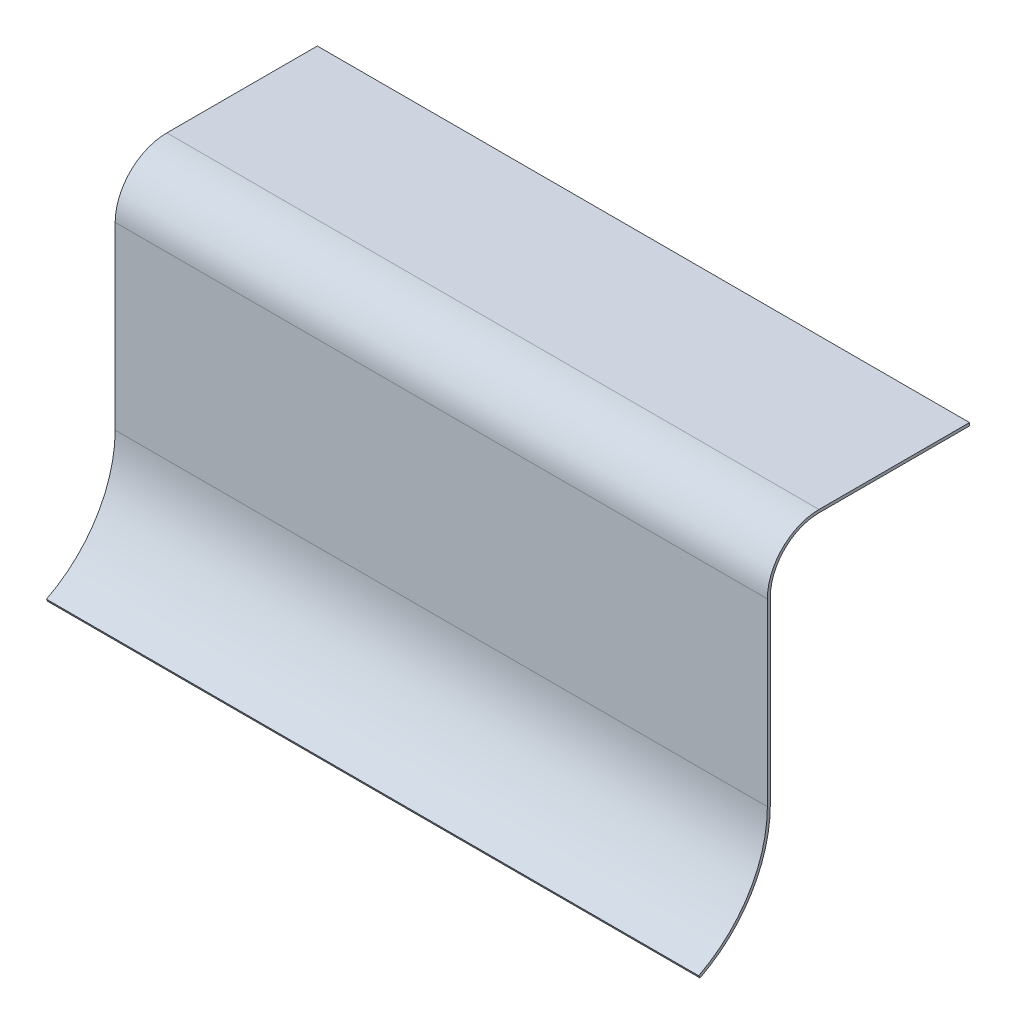
ISO-10303-21;
HEADER;
FILE_DESCRIPTION(('STEP AP214'),'2;1');
FILE_NAME('part.step','',(''),(''),'','','');
FILE_SCHEMA(('AUTOMOTIVE_DESIGN { 1 0 10303 214 1 1 1 1 }'));
ENDSEC;
DATA;
#1=APPLICATION_CONTEXT('core data for automotive mechanical design processes');
#2=APPLICATION_PROTOCOL_DEFINITION('international standard','automotive_design',2000,#1);
#3=PRODUCT_CONTEXT('',#1,'mechanical');
#4=PRODUCT('Part','Part','',(#3));
#5=PRODUCT_RELATED_PRODUCT_CATEGORY('part','',(#4));
#6=PRODUCT_DEFINITION_FORMATION('','',#4);
#7=PRODUCT_DEFINITION_CONTEXT('part definition',#1,'design');
#8=PRODUCT_DEFINITION('design','',#6,#7);
#9=PRODUCT_DEFINITION_SHAPE('','',#8);
#10=(LENGTH_UNIT() NAMED_UNIT(*) SI_UNIT(.MILLI.,.METRE.));
#11=(NAMED_UNIT(*) PLANE_ANGLE_UNIT() SI_UNIT($,.RADIAN.));
#12=(NAMED_UNIT(*) SI_UNIT($,.STERADIAN.) SOLID_ANGLE_UNIT());
#13=UNCERTAINTY_MEASURE_WITH_UNIT(LENGTH_MEASURE(1.E-05),#10,'distance_accuracy_value','');
#14=(GEOMETRIC_REPRESENTATION_CONTEXT(3) GLOBAL_UNCERTAINTY_ASSIGNED_CONTEXT((#13)) GLOBAL_UNIT_ASSIGNED_CONTEXT((#10,
#11,#12)) REPRESENTATION_CONTEXT('',''));
#15=CARTESIAN_POINT('',(0.,0.,0.));
#16=DIRECTION('',(0.,0.,1.));
#17=DIRECTION('',(1.,0.,0.));
#18=AXIS2_PLACEMENT_3D('',#15,#16,#17);
#19=CARTESIAN_POINT('',(165.1,-0.75,0.));
#20=DIRECTION('',(0.,1.,0.));
#21=DIRECTION('',(0.,0.,1.));
#22=AXIS2_PLACEMENT_3D('',#19,#20,#21);
#23=PLANE('',#22);
#24=DIRECTION('',(0.,0.,-1.));
#25=VECTOR('',#24,1.);
#26=CARTESIAN_POINT('',(-165.1,-0.75,0.));
#27=LINE('',#26,#25);
#28=CARTESIAN_POINT('',(-165.1,-0.75,0.));
#29=VERTEX_POINT('',#28);
#30=CARTESIAN_POINT('',(-165.1,-0.75,-76.2));
#31=VERTEX_POINT('',#30);
#32=EDGE_CURVE('E172',#29,#31,#27,.T.);
#33=ORIENTED_EDGE('',*,*,#32,.T.);
#34=DIRECTION('',(-1.,0.,0.));
#35=VECTOR('',#34,1.);
#36=CARTESIAN_POINT('',(165.1,-0.75,-76.2));
#37=LINE('',#36,#35);
#38=CARTESIAN_POINT('',(165.1,-0.75,-76.2));
#39=VERTEX_POINT('',#38);
#40=EDGE_CURVE('E11',#39,#31,#37,.T.);
#41=ORIENTED_EDGE('',*,*,#40,.F.);
#42=DIRECTION('',(0.,0.,-1.));
#43=VECTOR('',#42,1.);
#44=CARTESIAN_POINT('',(165.1,-0.75,0.));
#45=LINE('',#44,#43);
#46=CARTESIAN_POINT('',(165.1,-0.75,0.));
#47=VERTEX_POINT('',#46);
#48=EDGE_CURVE('E117',#47,#39,#45,.T.);
#49=ORIENTED_EDGE('',*,*,#48,.F.);
#50=DIRECTION('',(-1.,0.,0.));
#51=VECTOR('',#50,1.);
#52=CARTESIAN_POINT('',(165.1,-0.75,0.));
#53=LINE('',#52,#51);
#54=EDGE_CURVE('E168',#47,#29,#53,.T.);
#55=ORIENTED_EDGE('',*,*,#54,.T.);
#56=EDGE_LOOP('',(#33,#41,#49,#55));
#57=FACE_BOUND('',#56,.T.);
#58=ADVANCED_FACE('F38',(#57),#23,.F.);
#59=CARTESIAN_POINT('',(165.1,0.75,-76.2));
#60=DIRECTION('',(0.,0.,-1.));
#61=DIRECTION('',(-1.,0.,0.));
#62=AXIS2_PLACEMENT_3D('',#59,#60,#61);
#63=PLANE('',#62);
#64=DIRECTION('',(0.,-1.,0.));
#65=VECTOR('',#64,1.);
#66=CARTESIAN_POINT('',(-165.1,0.75,-76.2));
#67=LINE('',#66,#65);
#68=CARTESIAN_POINT('',(-165.1,0.75,-76.2));
#69=VERTEX_POINT('',#68);
#70=EDGE_CURVE('E176',#69,#31,#67,.T.);
#71=ORIENTED_EDGE('',*,*,#70,.F.);
#72=DIRECTION('',(-1.,0.,0.));
#73=VECTOR('',#72,1.);
#74=CARTESIAN_POINT('',(165.1,0.75,-76.2));
#75=LINE('',#74,#73);
#76=CARTESIAN_POINT('',(165.1,0.75,-76.2));
#77=VERTEX_POINT('',#76);
#78=EDGE_CURVE('E47',#77,#69,#75,.T.);
#79=ORIENTED_EDGE('',*,*,#78,.F.);
#80=DIRECTION('',(0.,-1.,0.));
#81=VECTOR('',#80,1.);
#82=CARTESIAN_POINT('',(165.1,0.75,-76.2));
#83=LINE('',#82,#81);
#84=EDGE_CURVE('E245',#77,#39,#83,.T.);
#85=ORIENTED_EDGE('',*,*,#84,.T.);
#86=ORIENTED_EDGE('',*,*,#40,.T.);
#87=EDGE_LOOP('',(#71,#79,#85,#86));
#88=FACE_BOUND('',#87,.T.);
#89=ADVANCED_FACE('F232',(#88),#63,.T.);
#90=CARTESIAN_POINT('',(165.1,0.75,0.));
#91=DIRECTION('',(0.,1.,0.));
#92=DIRECTION('',(0.,0.,1.));
#93=AXIS2_PLACEMENT_3D('',#90,#91,#92);
#94=PLANE('',#93);
#95=DIRECTION('',(0.,0.,-1.));
#96=VECTOR('',#95,1.);
#97=CARTESIAN_POINT('',(-165.1,0.75,0.));
#98=LINE('',#97,#96);
#99=CARTESIAN_POINT('',(-165.1,0.75,0.));
#100=VERTEX_POINT('',#99);
#101=EDGE_CURVE('E180',#100,#69,#98,.T.);
#102=ORIENTED_EDGE('',*,*,#101,.F.);
#103=DIRECTION('',(-1.,0.,0.));
#104=VECTOR('',#103,1.);
#105=CARTESIAN_POINT('',(165.1,0.75,0.));
#106=LINE('',#105,#104);
#107=CARTESIAN_POINT('',(165.1,0.75,0.));
#108=VERTEX_POINT('',#107);
#109=EDGE_CURVE('E220',#108,#100,#106,.T.);
#110=ORIENTED_EDGE('',*,*,#109,.F.);
#111=DIRECTION('',(0.,0.,-1.));
#112=VECTOR('',#111,1.);
#113=CARTESIAN_POINT('',(165.1,0.75,0.));
#114=LINE('',#113,#112);
#115=EDGE_CURVE('E229',#108,#77,#114,.T.);
#116=ORIENTED_EDGE('',*,*,#115,.T.);
#117=ORIENTED_EDGE('',*,*,#78,.T.);
#118=EDGE_LOOP('',(#102,#110,#116,#117));
#119=FACE_BOUND('',#118,.T.);
#120=ADVANCED_FACE('F227',(#119),#94,.T.);
#121=CARTESIAN_POINT('',(165.1,-25.4,0.));
#122=DIRECTION('',(-1.,0.,0.));
#123=DIRECTION('',(0.,0.,1.));
#124=AXIS2_PLACEMENT_3D('',#121,#122,#123);
#125=CYLINDRICAL_SURFACE('',#124,26.15);
#126=CARTESIAN_POINT('',(-165.1,-25.4,0.));
#127=DIRECTION('',(1.,0.,0.));
#128=DIRECTION('',(0.,0.,-1.));
#129=AXIS2_PLACEMENT_3D('',#126,#127,#128);
#130=CIRCLE('',#129,26.15);
#131=CARTESIAN_POINT('',(-165.1,-25.4,26.15));
#132=VERTEX_POINT('',#131);
#133=EDGE_CURVE('E184',#132,#100,#130,.F.);
#134=ORIENTED_EDGE('',*,*,#133,.F.);
#135=DIRECTION('',(-1.,0.,0.));
#136=VECTOR('',#135,1.);
#137=CARTESIAN_POINT('',(165.1,-25.4,26.15));
#138=LINE('',#137,#136);
#139=CARTESIAN_POINT('',(165.1,-25.4,26.15));
#140=VERTEX_POINT('',#139);
#141=EDGE_CURVE('E218',#140,#132,#138,.T.);
#142=ORIENTED_EDGE('',*,*,#141,.F.);
#143=CARTESIAN_POINT('',(165.1,-25.4,0.));
#144=DIRECTION('',(1.,0.,0.));
#145=DIRECTION('',(0.,0.,-1.));
#146=AXIS2_PLACEMENT_3D('',#143,#144,#145);
#147=CIRCLE('',#146,26.15);
#148=EDGE_CURVE('E242',#140,#108,#147,.F.);
#149=ORIENTED_EDGE('',*,*,#148,.T.);
#150=ORIENTED_EDGE('',*,*,#109,.T.);
#151=EDGE_LOOP('',(#134,#142,#149,#150));
#152=FACE_BOUND('',#151,.T.);
#153=ADVANCED_FACE('F239',(#152),#125,.T.);
#154=CARTESIAN_POINT('',(165.1,-116.494825288126,26.1499999999999));
#155=DIRECTION('',(0.,0.,1.));
#156=DIRECTION('',(0.,-1.,0.));
#157=AXIS2_PLACEMENT_3D('',#154,#155,#156);
#158=PLANE('',#157);
#159=DIRECTION('',(0.,1.,0.));
#160=VECTOR('',#159,1.);
#161=CARTESIAN_POINT('',(-165.1,-116.494825288126,26.1499999999999));
#162=LINE('',#161,#160);
#163=CARTESIAN_POINT('',(-165.1,-116.494825288126,26.1499999999999));
#164=VERTEX_POINT('',#163);
#165=EDGE_CURVE('E188',#164,#132,#162,.T.);
#166=ORIENTED_EDGE('',*,*,#165,.F.);
#167=DIRECTION('',(-1.,0.,0.));
#168=VECTOR('',#167,1.);
#169=CARTESIAN_POINT('',(165.1,-116.494825288126,26.1499999999999));
#170=LINE('',#169,#168);
#171=CARTESIAN_POINT('',(165.1,-116.494825288126,26.1499999999999));
#172=VERTEX_POINT('',#171);
#173=EDGE_CURVE('E215',#172,#164,#170,.T.);
#174=ORIENTED_EDGE('',*,*,#173,.F.);
#175=DIRECTION('',(0.,1.,0.));
#176=VECTOR('',#175,1.);
#177=CARTESIAN_POINT('',(165.1,-116.494825288126,26.1499999999999));
#178=LINE('',#177,#176);
#179=EDGE_CURVE('E251',#172,#140,#178,.T.);
#180=ORIENTED_EDGE('',*,*,#179,.T.);
#181=ORIENTED_EDGE('',*,*,#141,.T.);
#182=EDGE_LOOP('',(#166,#174,#180,#181));
#183=FACE_BOUND('',#182,.T.);
#184=ADVANCED_FACE('F287',(#183),#158,.T.);
#185=CARTESIAN_POINT('',(165.1,-116.494825288126,89.8250000000003));
#186=DIRECTION('',(-1.,0.,0.));
#187=DIRECTION('',(0.,0.,1.));
#188=AXIS2_PLACEMENT_3D('',#185,#186,#187);
#189=CYLINDRICAL_SURFACE('',#188,63.6750000000005);
#190=CARTESIAN_POINT('',(-165.1,-116.494825288126,89.8250000000003));
#191=DIRECTION('',(1.,0.,0.));
#192=DIRECTION('',(0.,0.,-1.));
#193=AXIS2_PLACEMENT_3D('',#190,#191,#192);
#194=CIRCLE('',#193,63.6750000000005);
#195=CARTESIAN_POINT('',(-165.1,-173.231720899745,60.921188809152));
#196=VERTEX_POINT('',#195);
#197=EDGE_CURVE('E192',#196,#164,#194,.T.);
#198=ORIENTED_EDGE('',*,*,#197,.F.);
#199=DIRECTION('',(-1.,0.,0.));
#200=VECTOR('',#199,1.);
#201=CARTESIAN_POINT('',(165.1,-173.231720899745,60.921188809152));
#202=LINE('',#201,#200);
#203=CARTESIAN_POINT('',(165.1,-173.231720899745,60.921188809152));
#204=VERTEX_POINT('',#203);
#205=EDGE_CURVE('E212',#204,#196,#202,.T.);
#206=ORIENTED_EDGE('',*,*,#205,.F.);
#207=CARTESIAN_POINT('',(165.1,-116.494825288126,89.8250000000003));
#208=DIRECTION('',(1.,0.,0.));
#209=DIRECTION('',(0.,0.,-1.));
#210=AXIS2_PLACEMENT_3D('',#207,#208,#209);
#211=CIRCLE('',#210,63.6750000000005);
#212=EDGE_CURVE('E257',#204,#172,#211,.T.);
#213=ORIENTED_EDGE('',*,*,#212,.T.);
#214=ORIENTED_EDGE('',*,*,#173,.T.);
#215=EDGE_LOOP('',(#198,#206,#213,#214));
#216=FACE_BOUND('',#215,.T.);
#217=ADVANCED_FACE('F290',(#216),#189,.F.);
#218=CARTESIAN_POINT('',(165.1,-174.568279100255,60.2402980861638));
#219=DIRECTION('',(0.,-0.453927148658783,0.891038800339529));
#220=DIRECTION('',(0.,-0.891038800339529,-0.453927148658783));
#221=AXIS2_PLACEMENT_3D('',#218,#219,#220);
#222=PLANE('',#221);
#223=DIRECTION('',(0.,0.891038800339529,0.453927148658783));
#224=VECTOR('',#223,1.);
#225=CARTESIAN_POINT('',(-165.1,-174.568279100255,60.2402980861638));
#226=LINE('',#225,#224);
#227=CARTESIAN_POINT('',(-165.1,-174.568279100255,60.2402980861638));
#228=VERTEX_POINT('',#227);
#229=EDGE_CURVE('E196',#228,#196,#226,.T.);
#230=ORIENTED_EDGE('',*,*,#229,.F.);
#231=DIRECTION('',(-1.,0.,0.));
#232=VECTOR('',#231,1.);
#233=CARTESIAN_POINT('',(165.1,-174.568279100255,60.2402980861638));
#234=LINE('',#233,#232);
#235=CARTESIAN_POINT('',(165.1,-174.568279100255,60.2402980861638));
#236=VERTEX_POINT('',#235);
#237=EDGE_CURVE('E159',#236,#228,#234,.T.);
#238=ORIENTED_EDGE('',*,*,#237,.F.);
#239=DIRECTION('',(0.,0.891038800339529,0.453927148658783));
#240=VECTOR('',#239,1.);
#241=CARTESIAN_POINT('',(165.1,-174.568279100255,60.2402980861638));
#242=LINE('',#241,#240);
#243=EDGE_CURVE('E150',#236,#204,#242,.T.);
#244=ORIENTED_EDGE('',*,*,#243,.T.);
#245=ORIENTED_EDGE('',*,*,#205,.T.);
#246=EDGE_LOOP('',(#230,#238,#244,#245));
#247=FACE_BOUND('',#246,.T.);
#248=ADVANCED_FACE('F263',(#247),#222,.T.);
#249=CARTESIAN_POINT('',(165.1,-116.494825288126,89.8250000000003));
#250=DIRECTION('',(-1.,0.,0.));
#251=DIRECTION('',(0.,0.,1.));
#252=AXIS2_PLACEMENT_3D('',#249,#250,#251);
#253=CYLINDRICAL_SURFACE('',#252,65.1750000000005);
#254=CARTESIAN_POINT('',(-165.1,-116.494825288126,89.8250000000003));
#255=DIRECTION('',(1.,0.,0.));
#256=DIRECTION('',(0.,0.,-1.));
#257=AXIS2_PLACEMENT_3D('',#254,#255,#256);
#258=CIRCLE('',#257,65.1750000000005);
#259=CARTESIAN_POINT('',(-165.1,-116.494825288126,24.6499999999999));
#260=VERTEX_POINT('',#259);
#261=EDGE_CURVE('E157',#228,#260,#258,.T.);
#262=ORIENTED_EDGE('',*,*,#261,.T.);
#263=DIRECTION('',(-1.,0.,0.));
#264=VECTOR('',#263,1.);
#265=CARTESIAN_POINT('',(165.1,-116.494825288126,24.6499999999999));
#266=LINE('',#265,#264);
#267=CARTESIAN_POINT('',(165.1,-116.494825288126,24.6499999999999));
#268=VERTEX_POINT('',#267);
#269=EDGE_CURVE('E154',#268,#260,#266,.T.);
#270=ORIENTED_EDGE('',*,*,#269,.F.);
#271=CARTESIAN_POINT('',(165.1,-116.494825288126,89.8250000000003));
#272=DIRECTION('',(1.,0.,0.));
#273=DIRECTION('',(0.,0.,-1.));
#274=AXIS2_PLACEMENT_3D('',#271,#272,#273);
#275=CIRCLE('',#274,65.1750000000005);
#276=EDGE_CURVE('E143',#236,#268,#275,.T.);
#277=ORIENTED_EDGE('',*,*,#276,.F.);
#278=ORIENTED_EDGE('',*,*,#237,.T.);
#279=EDGE_LOOP('',(#262,#270,#277,#278));
#280=FACE_BOUND('',#279,.T.);
#281=ADVANCED_FACE('F155',(#280),#253,.T.);
#282=CARTESIAN_POINT('',(165.1,-116.494825288126,24.6499999999999));
#283=DIRECTION('',(0.,0.,1.));
#284=DIRECTION('',(0.,-1.,0.));
#285=AXIS2_PLACEMENT_3D('',#282,#283,#284);
#286=PLANE('',#285);
#287=DIRECTION('',(0.,1.,0.));
#288=VECTOR('',#287,1.);
#289=CARTESIAN_POINT('',(-165.1,-116.494825288126,24.6499999999999));
#290=LINE('',#289,#288);
#291=CARTESIAN_POINT('',(-165.1,-25.4,24.65));
#292=VERTEX_POINT('',#291);
#293=EDGE_CURVE('E102',#260,#292,#290,.T.);
#294=ORIENTED_EDGE('',*,*,#293,.T.);
#295=DIRECTION('',(-1.,0.,0.));
#296=VECTOR('',#295,1.);
#297=CARTESIAN_POINT('',(165.1,-25.4,24.65));
#298=LINE('',#297,#296);
#299=CARTESIAN_POINT('',(165.1,-25.4,24.65));
#300=VERTEX_POINT('',#299);
#301=EDGE_CURVE('E160',#300,#292,#298,.T.);
#302=ORIENTED_EDGE('',*,*,#301,.F.);
#303=DIRECTION('',(0.,1.,0.));
#304=VECTOR('',#303,1.);
#305=CARTESIAN_POINT('',(165.1,-116.494825288126,24.6499999999999));
#306=LINE('',#305,#304);
#307=EDGE_CURVE('E147',#268,#300,#306,.T.);
#308=ORIENTED_EDGE('',*,*,#307,.F.);
#309=ORIENTED_EDGE('',*,*,#269,.T.);
#310=EDGE_LOOP('',(#294,#302,#308,#309));
#311=FACE_BOUND('',#310,.T.);
#312=ADVANCED_FACE('F162',(#311),#286,.F.);
#313=CARTESIAN_POINT('',(165.1,-25.4,0.));
#314=DIRECTION('',(-1.,0.,0.));
#315=DIRECTION('',(0.,0.,1.));
#316=AXIS2_PLACEMENT_3D('',#313,#314,#315);
#317=CYLINDRICAL_SURFACE('',#316,24.65);
#318=CARTESIAN_POINT('',(-165.1,-25.4,0.));
#319=DIRECTION('',(1.,0.,0.));
#320=DIRECTION('',(0.,0.,-1.));
#321=AXIS2_PLACEMENT_3D('',#318,#319,#320);
#322=CIRCLE('',#321,24.65);
#323=EDGE_CURVE('E109',#292,#29,#322,.F.);
#324=ORIENTED_EDGE('',*,*,#323,.T.);
#325=ORIENTED_EDGE('',*,*,#54,.F.);
#326=CARTESIAN_POINT('',(165.1,-25.4,0.));
#327=DIRECTION('',(1.,0.,0.));
#328=DIRECTION('',(0.,0.,-1.));
#329=AXIS2_PLACEMENT_3D('',#326,#327,#328);
#330=CIRCLE('',#329,24.65);
#331=EDGE_CURVE('E58',#300,#47,#330,.F.);
#332=ORIENTED_EDGE('',*,*,#331,.F.);
#333=ORIENTED_EDGE('',*,*,#301,.T.);
#334=EDGE_LOOP('',(#324,#325,#332,#333));
#335=FACE_BOUND('',#334,.T.);
#336=ADVANCED_FACE('F266',(#335),#317,.F.);
#337=CARTESIAN_POINT('',(165.1,-25.4,0.));
#338=DIRECTION('',(1.,0.,0.));
#339=DIRECTION('',(0.,0.,-1.));
#340=AXIS2_PLACEMENT_3D('',#337,#338,#339);
#341=PLANE('',#340);
#342=ORIENTED_EDGE('',*,*,#48,.T.);
#343=ORIENTED_EDGE('',*,*,#84,.F.);
#344=ORIENTED_EDGE('',*,*,#115,.F.);
#345=ORIENTED_EDGE('',*,*,#148,.F.);
#346=ORIENTED_EDGE('',*,*,#179,.F.);
#347=ORIENTED_EDGE('',*,*,#212,.F.);
#348=ORIENTED_EDGE('',*,*,#243,.F.);
#349=ORIENTED_EDGE('',*,*,#276,.T.);
#350=ORIENTED_EDGE('',*,*,#307,.T.);
#351=ORIENTED_EDGE('',*,*,#331,.T.);
#352=EDGE_LOOP('',(#342,#343,#344,#345,#346,#347,#348,#349,#350,#351));
#353=FACE_BOUND('',#352,.T.);
#354=ADVANCED_FACE('F145',(#353),#341,.T.);
#355=CARTESIAN_POINT('',(-165.1,-25.4,0.));
#356=DIRECTION('',(1.,0.,0.));
#357=DIRECTION('',(0.,0.,-1.));
#358=AXIS2_PLACEMENT_3D('',#355,#356,#357);
#359=PLANE('',#358);
#360=ORIENTED_EDGE('',*,*,#32,.F.);
#361=ORIENTED_EDGE('',*,*,#323,.F.);
#362=ORIENTED_EDGE('',*,*,#293,.F.);
#363=ORIENTED_EDGE('',*,*,#261,.F.);
#364=ORIENTED_EDGE('',*,*,#229,.T.);
#365=ORIENTED_EDGE('',*,*,#197,.T.);
#366=ORIENTED_EDGE('',*,*,#165,.T.);
#367=ORIENTED_EDGE('',*,*,#133,.T.);
#368=ORIENTED_EDGE('',*,*,#101,.T.);
#369=ORIENTED_EDGE('',*,*,#70,.T.);
#370=EDGE_LOOP('',(#360,#361,#362,#363,#364,#365,#366,#367,#368,#369));
#371=FACE_BOUND('',#370,.T.);
#372=ADVANCED_FACE('F235',(#371),#359,.F.);
#373=CLOSED_SHELL('',(#58,#89,#120,#153,#184,#217,#248,#281,#312,#336,#354,#372));
#374=MANIFOLD_SOLID_BREP('B2',#373);
#375=ADVANCED_BREP_SHAPE_REPRESENTATION('',(#18,#374),#14);
#376=SHAPE_DEFINITION_REPRESENTATION(#9,#375);
ENDSEC;
END-ISO-10303-21;
